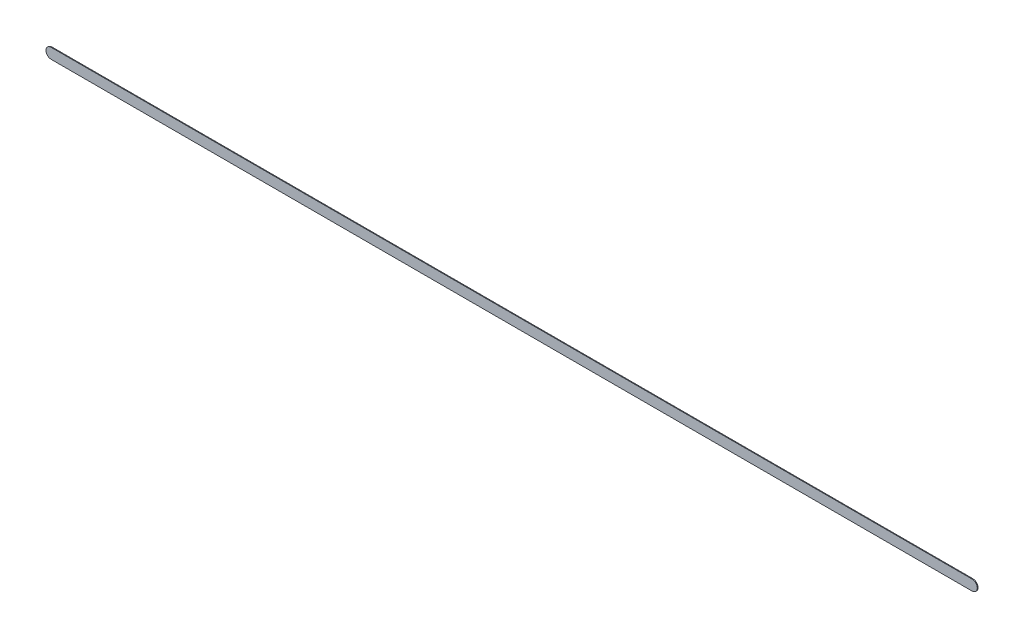
ISO-10303-21;
HEADER;
FILE_DESCRIPTION(('STEP AP214'),'2;1');
FILE_NAME('part.step','',(''),(''),'','','');
FILE_SCHEMA(('AUTOMOTIVE_DESIGN { 1 0 10303 214 1 1 1 1 }'));
ENDSEC;
DATA;
#1=APPLICATION_CONTEXT('core data for automotive mechanical design processes');
#2=APPLICATION_PROTOCOL_DEFINITION('international standard','automotive_design',2000,#1);
#3=PRODUCT_CONTEXT('',#1,'mechanical');
#4=PRODUCT('Part','Part','',(#3));
#5=PRODUCT_RELATED_PRODUCT_CATEGORY('part','',(#4));
#6=PRODUCT_DEFINITION_FORMATION('','',#4);
#7=PRODUCT_DEFINITION_CONTEXT('part definition',#1,'design');
#8=PRODUCT_DEFINITION('design','',#6,#7);
#9=PRODUCT_DEFINITION_SHAPE('','',#8);
#10=(LENGTH_UNIT() NAMED_UNIT(*) SI_UNIT(.MILLI.,.METRE.));
#11=(NAMED_UNIT(*) PLANE_ANGLE_UNIT() SI_UNIT($,.RADIAN.));
#12=(NAMED_UNIT(*) SI_UNIT($,.STERADIAN.) SOLID_ANGLE_UNIT());
#13=UNCERTAINTY_MEASURE_WITH_UNIT(LENGTH_MEASURE(1.E-05),#10,'distance_accuracy_value','');
#14=(GEOMETRIC_REPRESENTATION_CONTEXT(3) GLOBAL_UNCERTAINTY_ASSIGNED_CONTEXT((#13)) GLOBAL_UNIT_ASSIGNED_CONTEXT((#10,
#11,#12)) REPRESENTATION_CONTEXT('',''));
#15=CARTESIAN_POINT('',(0.,0.,0.));
#16=DIRECTION('',(0.,0.,1.));
#17=DIRECTION('',(1.,0.,0.));
#18=AXIS2_PLACEMENT_3D('',#15,#16,#17);
#19=CARTESIAN_POINT('',(120.142,-99.945,0.));
#20=DIRECTION('',(0.,0.,1.));
#21=DIRECTION('',(1.,0.,0.));
#22=AXIS2_PLACEMENT_3D('',#19,#20,#21);
#23=PLANE('',#22);
#24=DIRECTION('',(1.,0.,0.));
#25=VECTOR('',#24,1.);
#26=CARTESIAN_POINT('',(120.142,-99.945,0.));
#27=LINE('',#26,#25);
#28=CARTESIAN_POINT('',(120.142,-99.945,0.));
#29=VERTEX_POINT('',#28);
#30=CARTESIAN_POINT('',(164.338,-99.945,0.));
#31=VERTEX_POINT('',#30);
#32=EDGE_CURVE('E83',#29,#31,#27,.T.);
#33=ORIENTED_EDGE('',*,*,#32,.T.);
#34=CARTESIAN_POINT('',(164.338,-99.695,0.));
#35=DIRECTION('',(0.,0.,1.));
#36=DIRECTION('',(0.,-1.,0.));
#37=AXIS2_PLACEMENT_3D('',#34,#35,#36);
#38=CIRCLE('',#37,0.25);
#39=CARTESIAN_POINT('',(164.338,-99.445,0.));
#40=VERTEX_POINT('',#39);
#41=EDGE_CURVE('E106',#31,#40,#38,.T.);
#42=ORIENTED_EDGE('',*,*,#41,.T.);
#43=DIRECTION('',(-1.,0.,0.));
#44=VECTOR('',#43,1.);
#45=CARTESIAN_POINT('',(164.338,-99.445,0.));
#46=LINE('',#45,#44);
#47=CARTESIAN_POINT('',(120.142,-99.445,0.));
#48=VERTEX_POINT('',#47);
#49=EDGE_CURVE('E75',#40,#48,#46,.T.);
#50=ORIENTED_EDGE('',*,*,#49,.T.);
#51=CARTESIAN_POINT('',(120.142,-99.695,0.));
#52=DIRECTION('',(0.,0.,1.));
#53=DIRECTION('',(0.,1.,0.));
#54=AXIS2_PLACEMENT_3D('',#51,#52,#53);
#55=CIRCLE('',#54,0.25);
#56=EDGE_CURVE('E11',#48,#29,#55,.T.);
#57=ORIENTED_EDGE('',*,*,#56,.T.);
#58=EDGE_LOOP('',(#33,#42,#50,#57));
#59=FACE_BOUND('',#58,.T.);
#60=ADVANCED_FACE('F17',(#59),#23,.T.);
#61=CARTESIAN_POINT('',(120.142,-99.945,-0.035));
#62=DIRECTION('',(0.,0.,1.));
#63=DIRECTION('',(1.,0.,0.));
#64=AXIS2_PLACEMENT_3D('',#61,#62,#63);
#65=PLANE('',#64);
#66=CARTESIAN_POINT('',(120.142,-99.695,-0.035));
#67=DIRECTION('',(0.,0.,1.));
#68=DIRECTION('',(0.,1.,0.));
#69=AXIS2_PLACEMENT_3D('',#66,#67,#68);
#70=CIRCLE('',#69,0.25);
#71=CARTESIAN_POINT('',(120.142,-99.445,-0.035));
#72=VERTEX_POINT('',#71);
#73=CARTESIAN_POINT('',(120.142,-99.945,-0.035));
#74=VERTEX_POINT('',#73);
#75=EDGE_CURVE('E26',#72,#74,#70,.T.);
#76=ORIENTED_EDGE('',*,*,#75,.F.);
#77=DIRECTION('',(-1.,0.,0.));
#78=VECTOR('',#77,1.);
#79=CARTESIAN_POINT('',(164.338,-99.445,-0.035));
#80=LINE('',#79,#78);
#81=CARTESIAN_POINT('',(164.338,-99.445,-0.035));
#82=VERTEX_POINT('',#81);
#83=EDGE_CURVE('E110',#82,#72,#80,.T.);
#84=ORIENTED_EDGE('',*,*,#83,.F.);
#85=CARTESIAN_POINT('',(164.338,-99.695,-0.035));
#86=DIRECTION('',(0.,0.,1.));
#87=DIRECTION('',(0.,-1.,0.));
#88=AXIS2_PLACEMENT_3D('',#85,#86,#87);
#89=CIRCLE('',#88,0.25);
#90=CARTESIAN_POINT('',(164.338,-99.945,-0.035));
#91=VERTEX_POINT('',#90);
#92=EDGE_CURVE('E85',#91,#82,#89,.T.);
#93=ORIENTED_EDGE('',*,*,#92,.F.);
#94=DIRECTION('',(1.,0.,0.));
#95=VECTOR('',#94,1.);
#96=CARTESIAN_POINT('',(120.142,-99.945,-0.035));
#97=LINE('',#96,#95);
#98=EDGE_CURVE('E81',#74,#91,#97,.T.);
#99=ORIENTED_EDGE('',*,*,#98,.F.);
#100=EDGE_LOOP('',(#76,#84,#93,#99));
#101=FACE_BOUND('',#100,.T.);
#102=ADVANCED_FACE('F19',(#101),#65,.F.);
#103=CARTESIAN_POINT('',(120.142,-99.695,-0.035));
#104=DIRECTION('',(0.,0.,-1.));
#105=DIRECTION('',(0.,1.,0.));
#106=AXIS2_PLACEMENT_3D('',#103,#104,#105);
#107=CYLINDRICAL_SURFACE('',#106,0.25);
#108=ORIENTED_EDGE('',*,*,#75,.T.);
#109=DIRECTION('',(0.,0.,1.));
#110=VECTOR('',#109,1.);
#111=CARTESIAN_POINT('',(120.142,-99.945,-0.035));
#112=LINE('',#111,#110);
#113=EDGE_CURVE('E69',#74,#29,#112,.T.);
#114=ORIENTED_EDGE('',*,*,#113,.T.);
#115=ORIENTED_EDGE('',*,*,#56,.F.);
#116=DIRECTION('',(0.,0.,1.));
#117=VECTOR('',#116,1.);
#118=CARTESIAN_POINT('',(120.142,-99.445,-0.035));
#119=LINE('',#118,#117);
#120=EDGE_CURVE('E72',#72,#48,#119,.T.);
#121=ORIENTED_EDGE('',*,*,#120,.F.);
#122=EDGE_LOOP('',(#108,#114,#115,#121));
#123=FACE_BOUND('',#122,.T.);
#124=ADVANCED_FACE('F68',(#123),#107,.T.);
#125=CARTESIAN_POINT('',(164.338,-99.445,-0.035));
#126=DIRECTION('',(0.,-1.,0.));
#127=DIRECTION('',(0.,0.,-1.));
#128=AXIS2_PLACEMENT_3D('',#125,#126,#127);
#129=PLANE('',#128);
#130=ORIENTED_EDGE('',*,*,#83,.T.);
#131=ORIENTED_EDGE('',*,*,#120,.T.);
#132=ORIENTED_EDGE('',*,*,#49,.F.);
#133=DIRECTION('',(0.,0.,1.));
#134=VECTOR('',#133,1.);
#135=CARTESIAN_POINT('',(164.338,-99.445,-0.035));
#136=LINE('',#135,#134);
#137=EDGE_CURVE('E102',#82,#40,#136,.T.);
#138=ORIENTED_EDGE('',*,*,#137,.F.);
#139=EDGE_LOOP('',(#130,#131,#132,#138));
#140=FACE_BOUND('',#139,.T.);
#141=ADVANCED_FACE('F118',(#140),#129,.F.);
#142=CARTESIAN_POINT('',(164.338,-99.695,-0.035));
#143=DIRECTION('',(0.,0.,-1.));
#144=DIRECTION('',(0.,-1.,0.));
#145=AXIS2_PLACEMENT_3D('',#142,#143,#144);
#146=CYLINDRICAL_SURFACE('',#145,0.25);
#147=ORIENTED_EDGE('',*,*,#92,.T.);
#148=ORIENTED_EDGE('',*,*,#137,.T.);
#149=ORIENTED_EDGE('',*,*,#41,.F.);
#150=DIRECTION('',(0.,0.,1.));
#151=VECTOR('',#150,1.);
#152=CARTESIAN_POINT('',(164.338,-99.945,-0.035));
#153=LINE('',#152,#151);
#154=EDGE_CURVE('E90',#91,#31,#153,.T.);
#155=ORIENTED_EDGE('',*,*,#154,.F.);
#156=EDGE_LOOP('',(#147,#148,#149,#155));
#157=FACE_BOUND('',#156,.T.);
#158=ADVANCED_FACE('F161',(#157),#146,.T.);
#159=CARTESIAN_POINT('',(120.142,-99.945,-0.035));
#160=DIRECTION('',(0.,1.,0.));
#161=DIRECTION('',(1.,0.,0.));
#162=AXIS2_PLACEMENT_3D('',#159,#160,#161);
#163=PLANE('',#162);
#164=ORIENTED_EDGE('',*,*,#98,.T.);
#165=ORIENTED_EDGE('',*,*,#154,.T.);
#166=ORIENTED_EDGE('',*,*,#32,.F.);
#167=ORIENTED_EDGE('',*,*,#113,.F.);
#168=EDGE_LOOP('',(#164,#165,#166,#167));
#169=FACE_BOUND('',#168,.T.);
#170=ADVANCED_FACE('F79',(#169),#163,.F.);
#171=CLOSED_SHELL('',(#60,#102,#124,#141,#158,#170));
#172=MANIFOLD_SOLID_BREP('B1',#171);
#173=ADVANCED_BREP_SHAPE_REPRESENTATION('',(#18,#172),#14);
#174=SHAPE_DEFINITION_REPRESENTATION(#9,#173);
ENDSEC;
END-ISO-10303-21;
